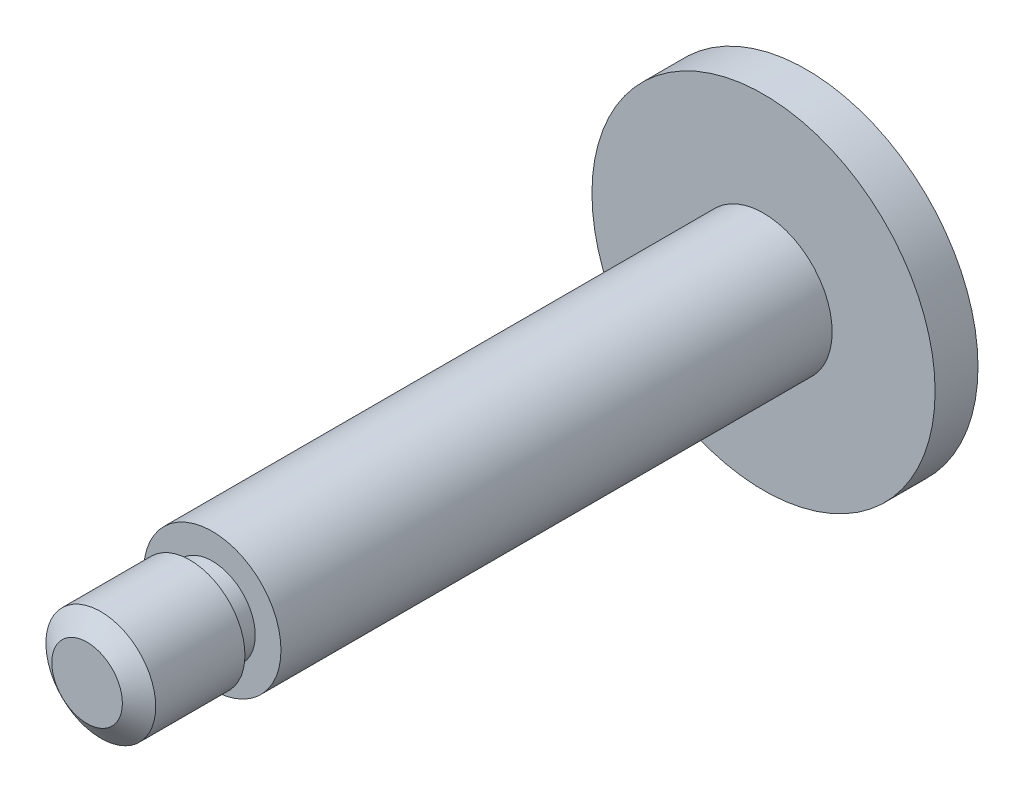
ISO-10303-21;
HEADER;
FILE_DESCRIPTION(('STEP AP214'),'2;1');
FILE_NAME('part.step','',(''),(''),'','','');
FILE_SCHEMA(('AUTOMOTIVE_DESIGN { 1 0 10303 214 1 1 1 1 }'));
ENDSEC;
DATA;
#1=APPLICATION_CONTEXT('core data for automotive mechanical design processes');
#2=APPLICATION_PROTOCOL_DEFINITION('international standard','automotive_design',2000,#1);
#3=PRODUCT_CONTEXT('',#1,'mechanical');
#4=PRODUCT('Part','Part','',(#3));
#5=PRODUCT_RELATED_PRODUCT_CATEGORY('part','',(#4));
#6=PRODUCT_DEFINITION_FORMATION('','',#4);
#7=PRODUCT_DEFINITION_CONTEXT('part definition',#1,'design');
#8=PRODUCT_DEFINITION('design','',#6,#7);
#9=PRODUCT_DEFINITION_SHAPE('','',#8);
#10=(LENGTH_UNIT() NAMED_UNIT(*) SI_UNIT(.MILLI.,.METRE.));
#11=(NAMED_UNIT(*) PLANE_ANGLE_UNIT() SI_UNIT($,.RADIAN.));
#12=(NAMED_UNIT(*) SI_UNIT($,.STERADIAN.) SOLID_ANGLE_UNIT());
#13=UNCERTAINTY_MEASURE_WITH_UNIT(LENGTH_MEASURE(1.E-05),#10,'distance_accuracy_value','');
#14=(GEOMETRIC_REPRESENTATION_CONTEXT(3) GLOBAL_UNCERTAINTY_ASSIGNED_CONTEXT((#13)) GLOBAL_UNIT_ASSIGNED_CONTEXT((#10,
#11,#12)) REPRESENTATION_CONTEXT('',''));
#15=CARTESIAN_POINT('',(0.,0.,0.));
#16=DIRECTION('',(0.,0.,1.));
#17=DIRECTION('',(1.,0.,0.));
#18=AXIS2_PLACEMENT_3D('',#15,#16,#17);
#19=CARTESIAN_POINT('',(0.,0.,5.));
#20=DIRECTION('',(0.,0.,-1.));
#21=DIRECTION('',(-1.,0.,0.));
#22=AXIS2_PLACEMENT_3D('',#19,#20,#21);
#23=CYLINDRICAL_SURFACE('',#22,20.);
#24=CARTESIAN_POINT('',(0.,0.,5.));
#25=DIRECTION('',(0.,0.,1.));
#26=DIRECTION('',(1.,0.,0.));
#27=AXIS2_PLACEMENT_3D('',#24,#25,#26);
#28=CIRCLE('',#27,20.);
#29=CARTESIAN_POINT('',(20.,0.,5.));
#30=VERTEX_POINT('',#29);
#31=EDGE_CURVE('E56',#30,#30,#28,.T.);
#32=ORIENTED_EDGE('',*,*,#31,.F.);
#33=EDGE_LOOP('',(#32));
#34=FACE_BOUND('',#33,.T.);
#35=CARTESIAN_POINT('',(0.,0.,0.));
#36=DIRECTION('',(0.,0.,1.));
#37=DIRECTION('',(1.,0.,0.));
#38=AXIS2_PLACEMENT_3D('',#35,#36,#37);
#39=CIRCLE('',#38,20.);
#40=CARTESIAN_POINT('',(20.,0.,0.));
#41=VERTEX_POINT('',#40);
#42=EDGE_CURVE('E60',#41,#41,#39,.T.);
#43=ORIENTED_EDGE('',*,*,#42,.T.);
#44=EDGE_LOOP('',(#43));
#45=FACE_BOUND('',#44,.T.);
#46=ADVANCED_FACE('F45',(#34,#45),#23,.T.);
#47=CARTESIAN_POINT('',(0.,0.,5.));
#48=DIRECTION('',(0.,0.,1.));
#49=DIRECTION('',(1.,0.,0.));
#50=AXIS2_PLACEMENT_3D('',#47,#48,#49);
#51=PLANE('',#50);
#52=CARTESIAN_POINT('',(0.,0.,5.));
#53=DIRECTION('',(0.,0.,1.));
#54=DIRECTION('',(1.,0.,0.));
#55=AXIS2_PLACEMENT_3D('',#52,#53,#54);
#56=CIRCLE('',#55,8.);
#57=CARTESIAN_POINT('',(8.,0.,5.));
#58=VERTEX_POINT('',#57);
#59=EDGE_CURVE('E66',#58,#58,#56,.T.);
#60=ORIENTED_EDGE('',*,*,#59,.F.);
#61=EDGE_LOOP('',(#60));
#62=FACE_BOUND('',#61,.T.);
#63=ORIENTED_EDGE('',*,*,#31,.T.);
#64=EDGE_LOOP('',(#63));
#65=FACE_BOUND('',#64,.T.);
#66=ADVANCED_FACE('F96',(#62,#65),#51,.T.);
#67=CARTESIAN_POINT('',(0.,0.,0.));
#68=DIRECTION('',(0.,0.,1.));
#69=DIRECTION('',(1.,0.,0.));
#70=AXIS2_PLACEMENT_3D('',#67,#68,#69);
#71=PLANE('',#70);
#72=ORIENTED_EDGE('',*,*,#42,.F.);
#73=EDGE_LOOP('',(#72));
#74=FACE_BOUND('',#73,.T.);
#75=ADVANCED_FACE('F101',(#74),#71,.F.);
#76=CARTESIAN_POINT('',(0.,0.,69.25));
#77=DIRECTION('',(0.,0.,-1.));
#78=DIRECTION('',(-1.,0.,0.));
#79=AXIS2_PLACEMENT_3D('',#76,#77,#78);
#80=CYLINDRICAL_SURFACE('',#79,8.);
#81=CARTESIAN_POINT('',(0.,0.,69.25));
#82=DIRECTION('',(0.,0.,1.));
#83=DIRECTION('',(1.,0.,0.));
#84=AXIS2_PLACEMENT_3D('',#81,#82,#83);
#85=CIRCLE('',#84,8.);
#86=CARTESIAN_POINT('',(8.,0.,69.25));
#87=VERTEX_POINT('',#86);
#88=EDGE_CURVE('E64',#87,#87,#85,.T.);
#89=ORIENTED_EDGE('',*,*,#88,.F.);
#90=EDGE_LOOP('',(#89));
#91=FACE_BOUND('',#90,.T.);
#92=ORIENTED_EDGE('',*,*,#59,.T.);
#93=EDGE_LOOP('',(#92));
#94=FACE_BOUND('',#93,.T.);
#95=ADVANCED_FACE('F108',(#91,#94),#80,.T.);
#96=CARTESIAN_POINT('',(0.,0.,69.25));
#97=DIRECTION('',(0.,0.,1.));
#98=DIRECTION('',(1.,0.,0.));
#99=AXIS2_PLACEMENT_3D('',#96,#97,#98);
#100=PLANE('',#99);
#101=CARTESIAN_POINT('',(0.,0.,69.25));
#102=DIRECTION('',(0.,0.,1.));
#103=DIRECTION('',(1.,0.,0.));
#104=AXIS2_PLACEMENT_3D('',#101,#102,#103);
#105=CIRCLE('',#104,5.);
#106=CARTESIAN_POINT('',(5.,0.,69.25));
#107=VERTEX_POINT('',#106);
#108=EDGE_CURVE('E72',#107,#107,#105,.T.);
#109=ORIENTED_EDGE('',*,*,#108,.F.);
#110=EDGE_LOOP('',(#109));
#111=FACE_BOUND('',#110,.T.);
#112=ORIENTED_EDGE('',*,*,#88,.T.);
#113=EDGE_LOOP('',(#112));
#114=FACE_BOUND('',#113,.T.);
#115=ADVANCED_FACE('F113',(#111,#114),#100,.T.);
#116=CARTESIAN_POINT('',(0.,0.,71.85));
#117=DIRECTION('',(0.,0.,-1.));
#118=DIRECTION('',(-1.,0.,0.));
#119=AXIS2_PLACEMENT_3D('',#116,#117,#118);
#120=CYLINDRICAL_SURFACE('',#119,5.);
#121=CARTESIAN_POINT('',(0.,0.,71.85));
#122=DIRECTION('',(0.,0.,1.));
#123=DIRECTION('',(1.,0.,0.));
#124=AXIS2_PLACEMENT_3D('',#121,#122,#123);
#125=CIRCLE('',#124,5.);
#126=CARTESIAN_POINT('',(5.,0.,71.85));
#127=VERTEX_POINT('',#126);
#128=EDGE_CURVE('E69',#127,#127,#125,.T.);
#129=ORIENTED_EDGE('',*,*,#128,.F.);
#130=EDGE_LOOP('',(#129));
#131=FACE_BOUND('',#130,.T.);
#132=ORIENTED_EDGE('',*,*,#108,.T.);
#133=EDGE_LOOP('',(#132));
#134=FACE_BOUND('',#133,.T.);
#135=ADVANCED_FACE('F117',(#131,#134),#120,.T.);
#136=CARTESIAN_POINT('',(0.,0.,83.85));
#137=DIRECTION('',(0.,0.,-1.));
#138=DIRECTION('',(-1.,0.,0.));
#139=AXIS2_PLACEMENT_3D('',#136,#137,#138);
#140=CYLINDRICAL_SURFACE('',#139,6.4);
#141=CARTESIAN_POINT('',(0.,0.,82.25));
#142=DIRECTION('',(0.,0.,1.));
#143=DIRECTION('',(1.,0.,0.));
#144=AXIS2_PLACEMENT_3D('',#141,#142,#143);
#145=CIRCLE('',#144,6.4);
#146=CARTESIAN_POINT('',(6.4,0.,82.25));
#147=VERTEX_POINT('',#146);
#148=EDGE_CURVE('E12',#147,#147,#145,.F.);
#149=ORIENTED_EDGE('',*,*,#148,.T.);
#150=EDGE_LOOP('',(#149));
#151=FACE_BOUND('',#150,.T.);
#152=CARTESIAN_POINT('',(0.,0.,71.85));
#153=DIRECTION('',(0.,0.,1.));
#154=DIRECTION('',(1.,0.,0.));
#155=AXIS2_PLACEMENT_3D('',#152,#153,#154);
#156=CIRCLE('',#155,6.4);
#157=CARTESIAN_POINT('',(6.4,0.,71.85));
#158=VERTEX_POINT('',#157);
#159=EDGE_CURVE('E75',#158,#158,#156,.T.);
#160=ORIENTED_EDGE('',*,*,#159,.T.);
#161=EDGE_LOOP('',(#160));
#162=FACE_BOUND('',#161,.T.);
#163=ADVANCED_FACE('F81',(#151,#162),#140,.T.);
#164=CARTESIAN_POINT('',(0.,0.,83.85));
#165=DIRECTION('',(0.,0.,1.));
#166=DIRECTION('',(1.,0.,0.));
#167=AXIS2_PLACEMENT_3D('',#164,#165,#166);
#168=PLANE('',#167);
#169=CARTESIAN_POINT('',(0.,0.,83.85));
#170=DIRECTION('',(0.,0.,1.));
#171=DIRECTION('',(1.,0.,0.));
#172=AXIS2_PLACEMENT_3D('',#169,#170,#171);
#173=CIRCLE('',#172,4.1149631892126);
#174=CARTESIAN_POINT('',(4.1149631892126,0.,83.85));
#175=VERTEX_POINT('',#174);
#176=EDGE_CURVE('E52',#175,#175,#173,.T.);
#177=ORIENTED_EDGE('',*,*,#176,.T.);
#178=EDGE_LOOP('',(#177));
#179=FACE_BOUND('',#178,.T.);
#180=ADVANCED_FACE('F85',(#179),#168,.T.);
#181=CARTESIAN_POINT('',(0.,0.,71.85));
#182=DIRECTION('',(0.,0.,1.));
#183=DIRECTION('',(1.,0.,0.));
#184=AXIS2_PLACEMENT_3D('',#181,#182,#183);
#185=PLANE('',#184);
#186=ORIENTED_EDGE('',*,*,#128,.T.);
#187=EDGE_LOOP('',(#186));
#188=FACE_BOUND('',#187,.T.);
#189=ORIENTED_EDGE('',*,*,#159,.F.);
#190=EDGE_LOOP('',(#189));
#191=FACE_BOUND('',#190,.T.);
#192=ADVANCED_FACE('F83',(#188,#191),#185,.F.);
#193=CARTESIAN_POINT('',(0.,0.,83.85));
#194=DIRECTION('',(0.,0.,-1.));
#195=DIRECTION('',(-1.,0.,0.));
#196=AXIS2_PLACEMENT_3D('',#193,#194,#195);
#197=CONICAL_SURFACE('',#196,4.1149631892126,0.959931088596883);
#198=ORIENTED_EDGE('',*,*,#148,.F.);
#199=EDGE_LOOP('',(#198));
#200=FACE_BOUND('',#199,.T.);
#201=ORIENTED_EDGE('',*,*,#176,.F.);
#202=EDGE_LOOP('',(#201));
#203=FACE_BOUND('',#202,.T.);
#204=ADVANCED_FACE('F47',(#200,#203),#197,.T.);
#205=CLOSED_SHELL('',(#46,#66,#75,#95,#115,#135,#163,#180,#192,#204));
#206=MANIFOLD_SOLID_BREP('B2',#205);
#207=ADVANCED_BREP_SHAPE_REPRESENTATION('',(#18,#206),#14);
#208=SHAPE_DEFINITION_REPRESENTATION(#9,#207);
ENDSEC;
END-ISO-10303-21;
